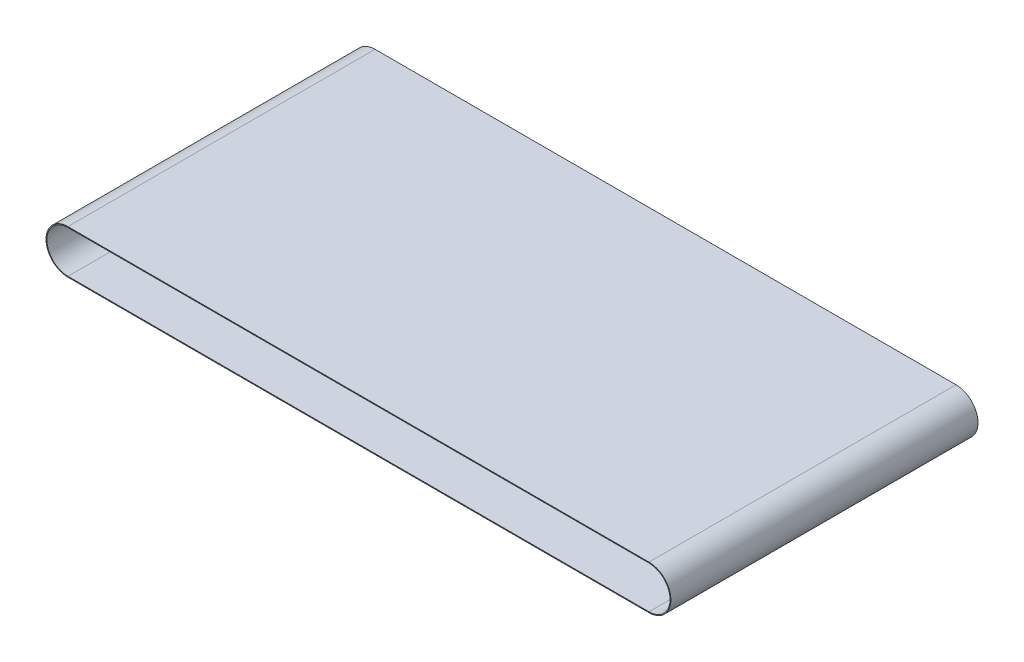
ISO-10303-21;
HEADER;
FILE_DESCRIPTION(('STEP AP214'),'2;1');
FILE_NAME('part.step','',(''),(''),'','','');
FILE_SCHEMA(('AUTOMOTIVE_DESIGN { 1 0 10303 214 1 1 1 1 }'));
ENDSEC;
DATA;
#1=APPLICATION_CONTEXT('core data for automotive mechanical design processes');
#2=APPLICATION_PROTOCOL_DEFINITION('international standard','automotive_design',2000,#1);
#3=PRODUCT_CONTEXT('',#1,'mechanical');
#4=PRODUCT('Part','Part','',(#3));
#5=PRODUCT_RELATED_PRODUCT_CATEGORY('part','',(#4));
#6=PRODUCT_DEFINITION_FORMATION('','',#4);
#7=PRODUCT_DEFINITION_CONTEXT('part definition',#1,'design');
#8=PRODUCT_DEFINITION('design','',#6,#7);
#9=PRODUCT_DEFINITION_SHAPE('','',#8);
#10=(LENGTH_UNIT() NAMED_UNIT(*) SI_UNIT(.MILLI.,.METRE.));
#11=(NAMED_UNIT(*) PLANE_ANGLE_UNIT() SI_UNIT($,.RADIAN.));
#12=(NAMED_UNIT(*) SI_UNIT($,.STERADIAN.) SOLID_ANGLE_UNIT());
#13=UNCERTAINTY_MEASURE_WITH_UNIT(LENGTH_MEASURE(1.E-05),#10,'distance_accuracy_value','');
#14=(GEOMETRIC_REPRESENTATION_CONTEXT(3) GLOBAL_UNCERTAINTY_ASSIGNED_CONTEXT((#13)) GLOBAL_UNIT_ASSIGNED_CONTEXT((#10,
#11,#12)) REPRESENTATION_CONTEXT('',''));
#15=CARTESIAN_POINT('',(0.,0.,0.));
#16=DIRECTION('',(0.,0.,1.));
#17=DIRECTION('',(1.,0.,0.));
#18=AXIS2_PLACEMENT_3D('',#15,#16,#17);
#19=CARTESIAN_POINT('',(-780.560496659773,161.,167.102157302187));
#20=DIRECTION('',(0.,-1.,0.));
#21=DIRECTION('',(1.,0.,0.));
#22=AXIS2_PLACEMENT_3D('',#19,#20,#21);
#23=PLANE('',#22);
#24=DIRECTION('',(1.,0.,0.));
#25=VECTOR('',#24,1.);
#26=CARTESIAN_POINT('',(-780.560496659773,161.,167.102157302187));
#27=LINE('',#26,#25);
#28=CARTESIAN_POINT('',(-780.560496659734,161.,167.102157302187));
#29=VERTEX_POINT('',#28);
#30=CARTESIAN_POINT('',(-80.5604966597662,161.,167.102157302187));
#31=VERTEX_POINT('',#30);
#32=EDGE_CURVE('E11',#29,#31,#27,.T.);
#33=ORIENTED_EDGE('',*,*,#32,.F.);
#34=DIRECTION('',(0.,0.,-1.));
#35=VECTOR('',#34,1.);
#36=CARTESIAN_POINT('',(-780.560496659734,161.000000000019,167.102157302187));
#37=LINE('',#36,#35);
#38=CARTESIAN_POINT('',(-780.560496659734,161.,-202.897842697813));
#39=VERTEX_POINT('',#38);
#40=EDGE_CURVE('E38',#29,#39,#37,.T.);
#41=ORIENTED_EDGE('',*,*,#40,.T.);
#42=DIRECTION('',(1.,0.,0.));
#43=VECTOR('',#42,1.);
#44=CARTESIAN_POINT('',(-780.560496659773,161.,-202.897842697813));
#45=LINE('',#44,#43);
#46=CARTESIAN_POINT('',(-80.5604966597662,161.,-202.897842697813));
#47=VERTEX_POINT('',#46);
#48=EDGE_CURVE('E123',#39,#47,#45,.T.);
#49=ORIENTED_EDGE('',*,*,#48,.T.);
#50=DIRECTION('',(0.,0.,-1.));
#51=VECTOR('',#50,1.);
#52=CARTESIAN_POINT('',(-80.5604966597662,161.,167.102157302187));
#53=LINE('',#52,#51);
#54=EDGE_CURVE('E126',#31,#47,#53,.T.);
#55=ORIENTED_EDGE('',*,*,#54,.F.);
#56=EDGE_LOOP('',(#33,#41,#49,#55));
#57=FACE_BOUND('',#56,.T.);
#58=ADVANCED_FACE('F35',(#57),#23,.T.);
#59=CARTESIAN_POINT('',(-780.560496659773,161.,167.102157302187));
#60=DIRECTION('',(0.,0.,1.));
#61=DIRECTION('',(1.,0.,0.));
#62=AXIS2_PLACEMENT_3D('',#59,#60,#61);
#63=PLANE('',#62);
#64=DIRECTION('',(1.,0.,0.));
#65=VECTOR('',#64,1.);
#66=CARTESIAN_POINT('',(-780.560496659773,162.,167.102157302187));
#67=LINE('',#66,#65);
#68=CARTESIAN_POINT('',(-780.560496659734,162.,167.102157302187));
#69=VERTEX_POINT('',#68);
#70=CARTESIAN_POINT('',(-80.5604966597662,162.,167.102157302187));
#71=VERTEX_POINT('',#70);
#72=EDGE_CURVE('E43',#69,#71,#67,.T.);
#73=ORIENTED_EDGE('',*,*,#72,.F.);
#74=DIRECTION('',(0.,-1.,0.));
#75=VECTOR('',#74,1.);
#76=CARTESIAN_POINT('',(-780.560496659734,161.000000000019,167.102157302187));
#77=LINE('',#76,#75);
#78=EDGE_CURVE('E193',#69,#29,#77,.T.);
#79=ORIENTED_EDGE('',*,*,#78,.T.);
#80=ORIENTED_EDGE('',*,*,#32,.T.);
#81=DIRECTION('',(0.,-1.,0.));
#82=VECTOR('',#81,1.);
#83=CARTESIAN_POINT('',(-80.5604966597662,161.,167.102157302187));
#84=LINE('',#83,#82);
#85=EDGE_CURVE('E151',#71,#31,#84,.T.);
#86=ORIENTED_EDGE('',*,*,#85,.F.);
#87=EDGE_LOOP('',(#73,#79,#80,#86));
#88=FACE_BOUND('',#87,.T.);
#89=ADVANCED_FACE('F217',(#88),#63,.T.);
#90=CARTESIAN_POINT('',(-780.560496659773,162.,167.102157302187));
#91=DIRECTION('',(0.,1.,0.));
#92=DIRECTION('',(-1.,0.,0.));
#93=AXIS2_PLACEMENT_3D('',#90,#91,#92);
#94=PLANE('',#93);
#95=DIRECTION('',(1.,0.,0.));
#96=VECTOR('',#95,1.);
#97=CARTESIAN_POINT('',(-780.560496659773,162.,-202.897842697813));
#98=LINE('',#97,#96);
#99=CARTESIAN_POINT('',(-780.560496659734,162.,-202.897842697813));
#100=VERTEX_POINT('',#99);
#101=CARTESIAN_POINT('',(-80.5604966597662,162.,-202.897842697813));
#102=VERTEX_POINT('',#101);
#103=EDGE_CURVE('E132',#100,#102,#98,.T.);
#104=ORIENTED_EDGE('',*,*,#103,.F.);
#105=DIRECTION('',(0.,0.,1.));
#106=VECTOR('',#105,1.);
#107=CARTESIAN_POINT('',(-780.560496659734,162.000000000019,167.102157302187));
#108=LINE('',#107,#106);
#109=EDGE_CURVE('E177',#100,#69,#108,.T.);
#110=ORIENTED_EDGE('',*,*,#109,.T.);
#111=ORIENTED_EDGE('',*,*,#72,.T.);
#112=DIRECTION('',(0.,0.,1.));
#113=VECTOR('',#112,1.);
#114=CARTESIAN_POINT('',(-80.5604966597662,162.,167.102157302187));
#115=LINE('',#114,#113);
#116=EDGE_CURVE('E155',#102,#71,#115,.T.);
#117=ORIENTED_EDGE('',*,*,#116,.F.);
#118=EDGE_LOOP('',(#104,#110,#111,#117));
#119=FACE_BOUND('',#118,.T.);
#120=ADVANCED_FACE('F222',(#119),#94,.T.);
#121=CARTESIAN_POINT('',(-780.560496659767,135.574025873386,-202.897842697813));
#122=DIRECTION('',(0.,0.,-1.));
#123=DIRECTION('',(0.,1.,0.));
#124=AXIS2_PLACEMENT_3D('',#121,#122,#123);
#125=CYLINDRICAL_SURFACE('',#124,25.4259741266135);
#126=ORIENTED_EDGE('',*,*,#40,.F.);
#127=CARTESIAN_POINT('',(-780.560496659767,135.574025873386,167.102157302187));
#128=DIRECTION('',(0.,0.,-1.));
#129=DIRECTION('',(-2.4452352963709E-13,-1.,0.));
#130=AXIS2_PLACEMENT_3D('',#127,#128,#129);
#131=CIRCLE('',#130,25.4259741266136);
#132=CARTESIAN_POINT('',(-780.560496659773,110.148051746773,167.102157302187));
#133=VERTEX_POINT('',#132);
#134=EDGE_CURVE('E79',#133,#29,#131,.T.);
#135=ORIENTED_EDGE('',*,*,#134,.F.);
#136=DIRECTION('',(0.,0.,-1.));
#137=VECTOR('',#136,1.);
#138=CARTESIAN_POINT('',(-780.560496659773,110.148051746773,167.102157302187));
#139=LINE('',#138,#137);
#140=CARTESIAN_POINT('',(-780.560496659773,110.148051746773,-202.897842697813));
#141=VERTEX_POINT('',#140);
#142=EDGE_CURVE('E180',#133,#141,#139,.T.);
#143=ORIENTED_EDGE('',*,*,#142,.T.);
#144=CARTESIAN_POINT('',(-780.560496659767,135.574025873386,-202.897842697813));
#145=DIRECTION('',(0.,0.,-1.));
#146=DIRECTION('',(-2.44523529637091E-13,-1.,0.));
#147=AXIS2_PLACEMENT_3D('',#144,#145,#146);
#148=CIRCLE('',#147,25.4259741266134);
#149=EDGE_CURVE('E175',#141,#39,#148,.T.);
#150=ORIENTED_EDGE('',*,*,#149,.T.);
#151=EDGE_LOOP('',(#126,#135,#143,#150));
#152=FACE_BOUND('',#151,.T.);
#153=ADVANCED_FACE('F206',(#152),#125,.F.);
#154=CARTESIAN_POINT('',(-780.560496659773,110.148051746772,167.102157302187));
#155=DIRECTION('',(0.,0.,1.));
#156=DIRECTION('',(0.,-1.,0.));
#157=AXIS2_PLACEMENT_3D('',#154,#155,#156);
#158=PLANE('',#157);
#159=ORIENTED_EDGE('',*,*,#134,.T.);
#160=ORIENTED_EDGE('',*,*,#78,.F.);
#161=CARTESIAN_POINT('',(-780.560496659767,135.574025873386,167.102157302187));
#162=DIRECTION('',(0.,0.,-1.));
#163=DIRECTION('',(-2.47874148892456E-13,-1.,0.));
#164=AXIS2_PLACEMENT_3D('',#161,#162,#163);
#165=CIRCLE('',#164,26.4259741266136);
#166=CARTESIAN_POINT('',(-780.560496659773,109.148051746773,167.102157302187));
#167=VERTEX_POINT('',#166);
#168=EDGE_CURVE('E88',#167,#69,#165,.T.);
#169=ORIENTED_EDGE('',*,*,#168,.F.);
#170=DIRECTION('',(0.,1.,0.));
#171=VECTOR('',#170,1.);
#172=CARTESIAN_POINT('',(-780.560496659773,110.148051746773,167.102157302187));
#173=LINE('',#172,#171);
#174=EDGE_CURVE('E189',#167,#133,#173,.T.);
#175=ORIENTED_EDGE('',*,*,#174,.T.);
#176=EDGE_LOOP('',(#159,#160,#169,#175));
#177=FACE_BOUND('',#176,.T.);
#178=ADVANCED_FACE('F216',(#177),#158,.T.);
#179=CARTESIAN_POINT('',(-780.560496659767,135.574025873386,-202.897842697813));
#180=DIRECTION('',(0.,0.,-1.));
#181=DIRECTION('',(0.,1.,0.));
#182=AXIS2_PLACEMENT_3D('',#179,#180,#181);
#183=CYLINDRICAL_SURFACE('',#182,26.4259741266136);
#184=ORIENTED_EDGE('',*,*,#168,.T.);
#185=ORIENTED_EDGE('',*,*,#109,.F.);
#186=CARTESIAN_POINT('',(-780.560496659767,135.574025873386,-202.897842697813));
#187=DIRECTION('',(0.,0.,-1.));
#188=DIRECTION('',(-2.43672892131568E-13,-1.,0.));
#189=AXIS2_PLACEMENT_3D('',#186,#187,#188);
#190=CIRCLE('',#189,26.4259741266135);
#191=CARTESIAN_POINT('',(-780.560496659773,109.148051746773,-202.897842697813));
#192=VERTEX_POINT('',#191);
#193=EDGE_CURVE('E96',#192,#100,#190,.T.);
#194=ORIENTED_EDGE('',*,*,#193,.F.);
#195=DIRECTION('',(0.,0.,1.));
#196=VECTOR('',#195,1.);
#197=CARTESIAN_POINT('',(-780.560496659773,109.148051746773,167.102157302187));
#198=LINE('',#197,#196);
#199=EDGE_CURVE('E169',#192,#167,#198,.T.);
#200=ORIENTED_EDGE('',*,*,#199,.T.);
#201=EDGE_LOOP('',(#184,#185,#194,#200));
#202=FACE_BOUND('',#201,.T.);
#203=ADVANCED_FACE('F223',(#202),#183,.T.);
#204=CARTESIAN_POINT('',(-780.560496659773,110.148051746773,-202.897842697813));
#205=DIRECTION('',(0.,0.,-1.));
#206=DIRECTION('',(0.,1.,0.));
#207=AXIS2_PLACEMENT_3D('',#204,#205,#206);
#208=PLANE('',#207);
#209=ORIENTED_EDGE('',*,*,#193,.T.);
#210=DIRECTION('',(0.,1.,0.));
#211=VECTOR('',#210,1.);
#212=CARTESIAN_POINT('',(-780.560496659734,161.000000000019,-202.897842697813));
#213=LINE('',#212,#211);
#214=EDGE_CURVE('E173',#39,#100,#213,.T.);
#215=ORIENTED_EDGE('',*,*,#214,.F.);
#216=ORIENTED_EDGE('',*,*,#149,.F.);
#217=DIRECTION('',(0.,-1.,0.));
#218=VECTOR('',#217,1.);
#219=CARTESIAN_POINT('',(-780.560496659773,110.148051746773,-202.897842697813));
#220=LINE('',#219,#218);
#221=EDGE_CURVE('E164',#141,#192,#220,.T.);
#222=ORIENTED_EDGE('',*,*,#221,.T.);
#223=EDGE_LOOP('',(#209,#215,#216,#222));
#224=FACE_BOUND('',#223,.T.);
#225=ADVANCED_FACE('F224',(#224),#208,.T.);
#226=CARTESIAN_POINT('',(-80.5604966597662,110.148051746772,167.102157302187));
#227=DIRECTION('',(0.,1.,0.));
#228=DIRECTION('',(0.,0.,1.));
#229=AXIS2_PLACEMENT_3D('',#226,#227,#228);
#230=PLANE('',#229);
#231=ORIENTED_EDGE('',*,*,#142,.F.);
#232=DIRECTION('',(-1.,0.,0.));
#233=VECTOR('',#232,1.);
#234=CARTESIAN_POINT('',(-80.5604966597662,110.148051746772,167.102157302187));
#235=LINE('',#234,#233);
#236=CARTESIAN_POINT('',(-80.5604966597662,110.148051746773,167.102157302187));
#237=VERTEX_POINT('',#236);
#238=EDGE_CURVE('E199',#237,#133,#235,.T.);
#239=ORIENTED_EDGE('',*,*,#238,.F.);
#240=DIRECTION('',(0.,0.,-1.));
#241=VECTOR('',#240,1.);
#242=CARTESIAN_POINT('',(-80.5604966597662,110.148051746773,167.102157302187));
#243=LINE('',#242,#241);
#244=CARTESIAN_POINT('',(-80.5604966597662,110.148051746773,-202.897842697813));
#245=VERTEX_POINT('',#244);
#246=EDGE_CURVE('E172',#237,#245,#243,.T.);
#247=ORIENTED_EDGE('',*,*,#246,.T.);
#248=DIRECTION('',(-1.,0.,0.));
#249=VECTOR('',#248,1.);
#250=CARTESIAN_POINT('',(-80.5604966597662,110.148051746773,-202.897842697813));
#251=LINE('',#250,#249);
#252=EDGE_CURVE('E167',#245,#141,#251,.T.);
#253=ORIENTED_EDGE('',*,*,#252,.T.);
#254=EDGE_LOOP('',(#231,#239,#247,#253));
#255=FACE_BOUND('',#254,.T.);
#256=ADVANCED_FACE('F211',(#255),#230,.T.);
#257=CARTESIAN_POINT('',(-80.5604966597662,110.148051746772,167.102157302187));
#258=DIRECTION('',(0.,0.,1.));
#259=DIRECTION('',(0.,-1.,0.));
#260=AXIS2_PLACEMENT_3D('',#257,#258,#259);
#261=PLANE('',#260);
#262=ORIENTED_EDGE('',*,*,#238,.T.);
#263=ORIENTED_EDGE('',*,*,#174,.F.);
#264=DIRECTION('',(-1.,0.,0.));
#265=VECTOR('',#264,1.);
#266=CARTESIAN_POINT('',(-80.5604966597662,109.148051746772,167.102157302187));
#267=LINE('',#266,#265);
#268=CARTESIAN_POINT('',(-80.5604966597662,109.148051746773,167.102157302187));
#269=VERTEX_POINT('',#268);
#270=EDGE_CURVE('E108',#269,#167,#267,.T.);
#271=ORIENTED_EDGE('',*,*,#270,.F.);
#272=DIRECTION('',(0.,1.,0.));
#273=VECTOR('',#272,1.);
#274=CARTESIAN_POINT('',(-80.5604966597662,110.148051746773,167.102157302187));
#275=LINE('',#274,#273);
#276=EDGE_CURVE('E186',#269,#237,#275,.T.);
#277=ORIENTED_EDGE('',*,*,#276,.T.);
#278=EDGE_LOOP('',(#262,#263,#271,#277));
#279=FACE_BOUND('',#278,.T.);
#280=ADVANCED_FACE('F215',(#279),#261,.T.);
#281=CARTESIAN_POINT('',(-80.5604966597662,109.148051746772,167.102157302187));
#282=DIRECTION('',(0.,-1.,0.));
#283=DIRECTION('',(0.,0.,-1.));
#284=AXIS2_PLACEMENT_3D('',#281,#282,#283);
#285=PLANE('',#284);
#286=ORIENTED_EDGE('',*,*,#270,.T.);
#287=ORIENTED_EDGE('',*,*,#199,.F.);
#288=DIRECTION('',(-1.,0.,0.));
#289=VECTOR('',#288,1.);
#290=CARTESIAN_POINT('',(-80.5604966597662,109.148051746773,-202.897842697813));
#291=LINE('',#290,#289);
#292=CARTESIAN_POINT('',(-80.5604966597662,109.148051746773,-202.897842697813));
#293=VERTEX_POINT('',#292);
#294=EDGE_CURVE('E114',#293,#192,#291,.T.);
#295=ORIENTED_EDGE('',*,*,#294,.F.);
#296=DIRECTION('',(0.,0.,1.));
#297=VECTOR('',#296,1.);
#298=CARTESIAN_POINT('',(-80.5604966597662,109.148051746773,167.102157302187));
#299=LINE('',#298,#297);
#300=EDGE_CURVE('E162',#293,#269,#299,.T.);
#301=ORIENTED_EDGE('',*,*,#300,.T.);
#302=EDGE_LOOP('',(#286,#287,#295,#301));
#303=FACE_BOUND('',#302,.T.);
#304=ADVANCED_FACE('F277',(#303),#285,.T.);
#305=CARTESIAN_POINT('',(-80.5604966597662,110.148051746773,-202.897842697813));
#306=DIRECTION('',(0.,0.,-1.));
#307=DIRECTION('',(0.,1.,0.));
#308=AXIS2_PLACEMENT_3D('',#305,#306,#307);
#309=PLANE('',#308);
#310=ORIENTED_EDGE('',*,*,#294,.T.);
#311=ORIENTED_EDGE('',*,*,#221,.F.);
#312=ORIENTED_EDGE('',*,*,#252,.F.);
#313=DIRECTION('',(0.,-1.,0.));
#314=VECTOR('',#313,1.);
#315=CARTESIAN_POINT('',(-80.5604966597662,110.148051746773,-202.897842697813));
#316=LINE('',#315,#314);
#317=EDGE_CURVE('E143',#245,#293,#316,.T.);
#318=ORIENTED_EDGE('',*,*,#317,.T.);
#319=EDGE_LOOP('',(#310,#311,#312,#318));
#320=FACE_BOUND('',#319,.T.);
#321=ADVANCED_FACE('F209',(#320),#309,.T.);
#322=CARTESIAN_POINT('',(-80.5604966597662,135.574025873386,-202.897842697813));
#323=DIRECTION('',(0.,0.,-1.));
#324=DIRECTION('',(0.,1.,0.));
#325=AXIS2_PLACEMENT_3D('',#322,#323,#324);
#326=CYLINDRICAL_SURFACE('',#325,25.4259741266136);
#327=ORIENTED_EDGE('',*,*,#246,.F.);
#328=CARTESIAN_POINT('',(-80.5604966597662,135.574025873386,167.102157302187));
#329=DIRECTION('',(0.,0.,-1.));
#330=DIRECTION('',(0.,1.,0.));
#331=AXIS2_PLACEMENT_3D('',#328,#329,#330);
#332=CIRCLE('',#331,25.4259741266137);
#333=EDGE_CURVE('E150',#31,#237,#332,.T.);
#334=ORIENTED_EDGE('',*,*,#333,.F.);
#335=ORIENTED_EDGE('',*,*,#54,.T.);
#336=CARTESIAN_POINT('',(-80.5604966597662,135.574025873386,-202.897842697813));
#337=DIRECTION('',(0.,0.,-1.));
#338=DIRECTION('',(0.,1.,0.));
#339=AXIS2_PLACEMENT_3D('',#336,#337,#338);
#340=CIRCLE('',#339,25.4259741266135);
#341=EDGE_CURVE('E138',#47,#245,#340,.T.);
#342=ORIENTED_EDGE('',*,*,#341,.T.);
#343=EDGE_LOOP('',(#327,#334,#335,#342));
#344=FACE_BOUND('',#343,.T.);
#345=ADVANCED_FACE('F148',(#344),#326,.F.);
#346=CARTESIAN_POINT('',(-80.5604966597662,161.,167.102157302187));
#347=DIRECTION('',(0.,0.,1.));
#348=DIRECTION('',(0.,-1.,0.));
#349=AXIS2_PLACEMENT_3D('',#346,#347,#348);
#350=PLANE('',#349);
#351=ORIENTED_EDGE('',*,*,#333,.T.);
#352=ORIENTED_EDGE('',*,*,#276,.F.);
#353=CARTESIAN_POINT('',(-80.5604966597662,135.574025873386,167.102157302187));
#354=DIRECTION('',(0.,0.,-1.));
#355=DIRECTION('',(0.,1.,0.));
#356=AXIS2_PLACEMENT_3D('',#353,#354,#355);
#357=CIRCLE('',#356,26.4259741266137);
#358=EDGE_CURVE('E183',#71,#269,#357,.T.);
#359=ORIENTED_EDGE('',*,*,#358,.F.);
#360=ORIENTED_EDGE('',*,*,#85,.T.);
#361=EDGE_LOOP('',(#351,#352,#359,#360));
#362=FACE_BOUND('',#361,.T.);
#363=ADVANCED_FACE('F213',(#362),#350,.T.);
#364=CARTESIAN_POINT('',(-80.5604966597662,135.574025873386,-202.897842697813));
#365=DIRECTION('',(0.,0.,-1.));
#366=DIRECTION('',(0.,1.,0.));
#367=AXIS2_PLACEMENT_3D('',#364,#365,#366);
#368=CYLINDRICAL_SURFACE('',#367,26.4259741266137);
#369=ORIENTED_EDGE('',*,*,#358,.T.);
#370=ORIENTED_EDGE('',*,*,#300,.F.);
#371=CARTESIAN_POINT('',(-80.5604966597662,135.574025873386,-202.897842697813));
#372=DIRECTION('',(0.,0.,-1.));
#373=DIRECTION('',(0.,1.,0.));
#374=AXIS2_PLACEMENT_3D('',#371,#372,#373);
#375=CIRCLE('',#374,26.4259741266136);
#376=EDGE_CURVE('E161',#102,#293,#375,.T.);
#377=ORIENTED_EDGE('',*,*,#376,.F.);
#378=ORIENTED_EDGE('',*,*,#116,.T.);
#379=EDGE_LOOP('',(#369,#370,#377,#378));
#380=FACE_BOUND('',#379,.T.);
#381=ADVANCED_FACE('F220',(#380),#368,.T.);
#382=CARTESIAN_POINT('',(-80.5604966597662,161.,-202.897842697813));
#383=DIRECTION('',(0.,0.,-1.));
#384=DIRECTION('',(0.,1.,0.));
#385=AXIS2_PLACEMENT_3D('',#382,#383,#384);
#386=PLANE('',#385);
#387=ORIENTED_EDGE('',*,*,#376,.T.);
#388=ORIENTED_EDGE('',*,*,#317,.F.);
#389=ORIENTED_EDGE('',*,*,#341,.F.);
#390=DIRECTION('',(0.,1.,0.));
#391=VECTOR('',#390,1.);
#392=CARTESIAN_POINT('',(-80.5604966597662,161.,-202.897842697813));
#393=LINE('',#392,#391);
#394=EDGE_CURVE('E141',#47,#102,#393,.T.);
#395=ORIENTED_EDGE('',*,*,#394,.T.);
#396=EDGE_LOOP('',(#387,#388,#389,#395));
#397=FACE_BOUND('',#396,.T.);
#398=ADVANCED_FACE('F140',(#397),#386,.T.);
#399=CARTESIAN_POINT('',(-780.560496659773,161.,-202.897842697813));
#400=DIRECTION('',(0.,0.,-1.));
#401=DIRECTION('',(-1.,0.,0.));
#402=AXIS2_PLACEMENT_3D('',#399,#400,#401);
#403=PLANE('',#402);
#404=ORIENTED_EDGE('',*,*,#214,.T.);
#405=ORIENTED_EDGE('',*,*,#103,.T.);
#406=ORIENTED_EDGE('',*,*,#394,.F.);
#407=ORIENTED_EDGE('',*,*,#48,.F.);
#408=EDGE_LOOP('',(#404,#405,#406,#407));
#409=FACE_BOUND('',#408,.T.);
#410=ADVANCED_FACE('F153',(#409),#403,.T.);
#411=CLOSED_SHELL('',(#58,#89,#120,#153,#178,#203,#225,#256,#280,#304,#321,#345,#363,#381,#398,#410));
#412=MANIFOLD_SOLID_BREP('B2',#411);
#413=ADVANCED_BREP_SHAPE_REPRESENTATION('',(#18,#412),#14);
#414=SHAPE_DEFINITION_REPRESENTATION(#9,#413);
ENDSEC;
END-ISO-10303-21;
